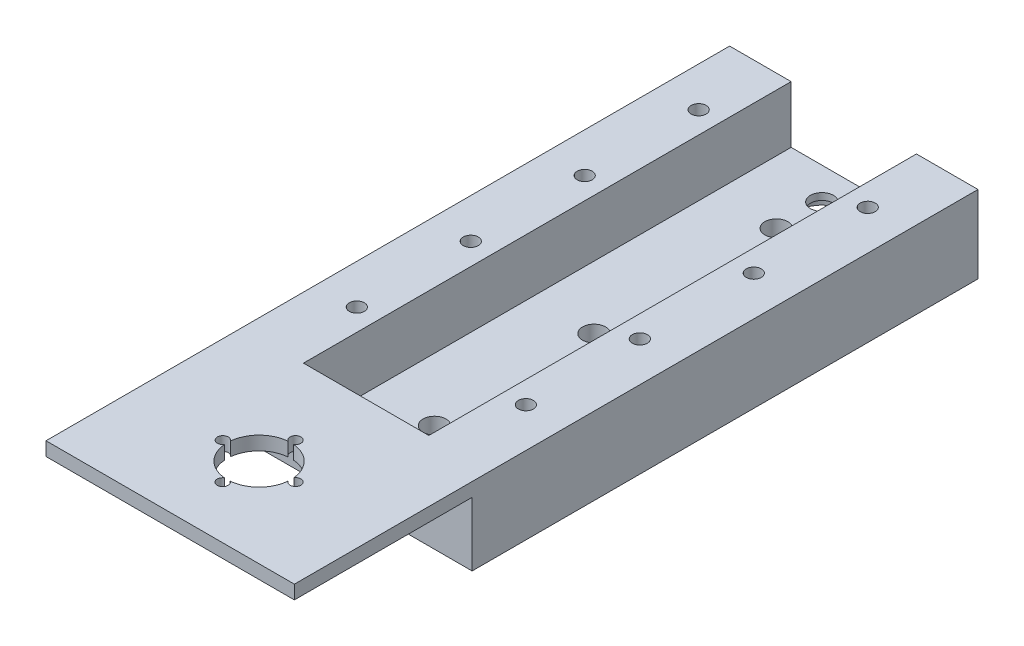
ISO-10303-21;
HEADER;
FILE_DESCRIPTION(('STEP AP214'),'2;1');
FILE_NAME('part.step','',(''),(''),'','','');
FILE_SCHEMA(('AUTOMOTIVE_DESIGN { 1 0 10303 214 1 1 1 1 }'));
ENDSEC;
DATA;
#1=APPLICATION_CONTEXT('core data for automotive mechanical design processes');
#2=APPLICATION_PROTOCOL_DEFINITION('international standard','automotive_design',2000,#1);
#3=PRODUCT_CONTEXT('',#1,'mechanical');
#4=PRODUCT('Part','Part','',(#3));
#5=PRODUCT_RELATED_PRODUCT_CATEGORY('part','',(#4));
#6=PRODUCT_DEFINITION_FORMATION('','',#4);
#7=PRODUCT_DEFINITION_CONTEXT('part definition',#1,'design');
#8=PRODUCT_DEFINITION('design','',#6,#7);
#9=PRODUCT_DEFINITION_SHAPE('','',#8);
#10=(LENGTH_UNIT() NAMED_UNIT(*) SI_UNIT(.MILLI.,.METRE.));
#11=(NAMED_UNIT(*) PLANE_ANGLE_UNIT() SI_UNIT($,.RADIAN.));
#12=(NAMED_UNIT(*) SI_UNIT($,.STERADIAN.) SOLID_ANGLE_UNIT());
#13=UNCERTAINTY_MEASURE_WITH_UNIT(LENGTH_MEASURE(1.E-05),#10,'distance_accuracy_value','');
#14=(GEOMETRIC_REPRESENTATION_CONTEXT(3) GLOBAL_UNCERTAINTY_ASSIGNED_CONTEXT((#13)) GLOBAL_UNIT_ASSIGNED_CONTEXT((#10,
#11,#12)) REPRESENTATION_CONTEXT('',''));
#15=CARTESIAN_POINT('',(0.,0.,0.));
#16=DIRECTION('',(0.,0.,1.));
#17=DIRECTION('',(1.,0.,0.));
#18=AXIS2_PLACEMENT_3D('',#15,#16,#17);
#19=CARTESIAN_POINT('',(-13.3995438408786,4.5,-92.6293125841432));
#20=DIRECTION('',(0.,1.,0.));
#21=DIRECTION('',(0.,0.,1.));
#22=AXIS2_PLACEMENT_3D('',#19,#20,#21);
#23=CYLINDRICAL_SURFACE('',#22,2.5273);
#24=CARTESIAN_POINT('',(-13.3995438408786,4.5,-92.6293125841432));
#25=DIRECTION('',(0.,1.,0.));
#26=DIRECTION('',(0.,0.,1.));
#27=AXIS2_PLACEMENT_3D('',#24,#25,#26);
#28=CIRCLE('',#27,2.5273);
#29=CARTESIAN_POINT('',(-13.3995438408786,4.5,-90.1020125841432));
#30=VERTEX_POINT('',#29);
#31=EDGE_CURVE('E168',#30,#30,#28,.T.);
#32=ORIENTED_EDGE('',*,*,#31,.T.);
#33=EDGE_LOOP('',(#32));
#34=FACE_BOUND('',#33,.T.);
#35=CARTESIAN_POINT('',(-13.3995438408786,3.,-92.6293125841432));
#36=DIRECTION('',(0.,-1.,0.));
#37=DIRECTION('',(0.,0.,-1.));
#38=AXIS2_PLACEMENT_3D('',#35,#36,#37);
#39=CIRCLE('',#38,2.5273);
#40=CARTESIAN_POINT('',(-13.3995438408786,3.,-95.1566125841432));
#41=VERTEX_POINT('',#40);
#42=EDGE_CURVE('E41',#41,#41,#39,.F.);
#43=ORIENTED_EDGE('',*,*,#42,.F.);
#44=EDGE_LOOP('',(#43));
#45=FACE_BOUND('',#44,.T.);
#46=ADVANCED_FACE('F37',(#34,#45),#23,.F.);
#47=CARTESIAN_POINT('',(-13.3995438408786,14.,30.8706874158568));
#48=DIRECTION('',(0.,1.,0.));
#49=DIRECTION('',(0.,0.,1.));
#50=AXIS2_PLACEMENT_3D('',#47,#48,#49);
#51=CYLINDRICAL_SURFACE('',#50,7.);
#52=CARTESIAN_POINT('',(-13.3995438408786,14.,30.8706874158568));
#53=DIRECTION('',(0.,1.,0.));
#54=DIRECTION('',(0.,0.,1.));
#55=AXIS2_PLACEMENT_3D('',#52,#53,#54);
#56=CIRCLE('',#55,7.);
#57=CARTESIAN_POINT('',(-20.3703289447228,14.,31.5095575403921));
#58=VERTEX_POINT('',#57);
#59=CARTESIAN_POINT('',(-14.0194178200066,14.,37.8431874158568));
#60=VERTEX_POINT('',#59);
#61=EDGE_CURVE('E176',#58,#60,#56,.T.);
#62=ORIENTED_EDGE('',*,*,#61,.F.);
#63=DIRECTION('',(0.,1.,0.));
#64=VECTOR('',#63,1.);
#65=CARTESIAN_POINT('',(-20.3703289447228,8.5,31.5095575403921));
#66=LINE('',#65,#64);
#67=CARTESIAN_POINT('',(-20.3703289447228,17.,31.5095575403921));
#68=VERTEX_POINT('',#67);
#69=EDGE_CURVE('E53',#58,#68,#66,.T.);
#70=ORIENTED_EDGE('',*,*,#69,.T.);
#71=CARTESIAN_POINT('',(-13.3995438408786,17.,30.8706874158568));
#72=DIRECTION('',(0.,1.,0.));
#73=DIRECTION('',(0.,0.,1.));
#74=AXIS2_PLACEMENT_3D('',#71,#72,#73);
#75=CIRCLE('',#74,7.);
#76=CARTESIAN_POINT('',(-14.0194178200066,17.,37.8431874158568));
#77=VERTEX_POINT('',#76);
#78=EDGE_CURVE('E174',#68,#77,#75,.T.);
#79=ORIENTED_EDGE('',*,*,#78,.T.);
#80=DIRECTION('',(0.,1.,0.));
#81=VECTOR('',#80,1.);
#82=CARTESIAN_POINT('',(-14.0194178200066,8.5,37.8431874158568));
#83=LINE('',#82,#81);
#84=EDGE_CURVE('E217',#77,#60,#83,.F.);
#85=ORIENTED_EDGE('',*,*,#84,.T.);
#86=EDGE_LOOP('',(#62,#70,#79,#85));
#87=FACE_BOUND('',#86,.T.);
#88=ADVANCED_FACE('F172',(#87),#51,.F.);
#89=CARTESIAN_POINT('',(0.,17.,0.));
#90=DIRECTION('',(0.,-1.,0.));
#91=DIRECTION('',(0.,0.,-1.));
#92=AXIS2_PLACEMENT_3D('',#89,#90,#91);
#93=PLANE('',#92);
#94=CARTESIAN_POINT('',(5.15045615912143,17.,-9.1293125841432));
#95=DIRECTION('',(0.,1.,0.));
#96=DIRECTION('',(0.,0.,1.));
#97=AXIS2_PLACEMENT_3D('',#94,#95,#96);
#98=CIRCLE('',#97,1.65);
#99=CARTESIAN_POINT('',(5.15045615912143,17.,-7.4793125841432));
#100=VERTEX_POINT('',#99);
#101=EDGE_CURVE('E311',#100,#100,#98,.T.);
#102=ORIENTED_EDGE('',*,*,#101,.F.);
#103=EDGE_LOOP('',(#102));
#104=FACE_BOUND('',#103,.T.);
#105=CARTESIAN_POINT('',(5.15045615912143,17.,-34.1293125841432));
#106=DIRECTION('',(0.,1.,0.));
#107=DIRECTION('',(0.,0.,1.));
#108=AXIS2_PLACEMENT_3D('',#105,#106,#107);
#109=CIRCLE('',#108,1.65);
#110=CARTESIAN_POINT('',(5.15045615912143,17.,-32.4793125841432));
#111=VERTEX_POINT('',#110);
#112=EDGE_CURVE('E305',#111,#111,#109,.T.);
#113=ORIENTED_EDGE('',*,*,#112,.F.);
#114=EDGE_LOOP('',(#113));
#115=FACE_BOUND('',#114,.T.);
#116=CARTESIAN_POINT('',(5.15045615912143,17.,-59.1293125841432));
#117=DIRECTION('',(0.,1.,0.));
#118=DIRECTION('',(0.,0.,1.));
#119=AXIS2_PLACEMENT_3D('',#116,#117,#118);
#120=CIRCLE('',#119,1.65);
#121=CARTESIAN_POINT('',(5.15045615912143,17.,-57.4793125841432));
#122=VERTEX_POINT('',#121);
#123=EDGE_CURVE('E299',#122,#122,#120,.T.);
#124=ORIENTED_EDGE('',*,*,#123,.F.);
#125=EDGE_LOOP('',(#124));
#126=FACE_BOUND('',#125,.T.);
#127=CARTESIAN_POINT('',(5.15045615912143,17.,-84.1293125841432));
#128=DIRECTION('',(0.,1.,0.));
#129=DIRECTION('',(0.,0.,1.));
#130=AXIS2_PLACEMENT_3D('',#127,#128,#129);
#131=CIRCLE('',#130,1.65);
#132=CARTESIAN_POINT('',(5.15045615912143,17.,-82.4793125841432));
#133=VERTEX_POINT('',#132);
#134=EDGE_CURVE('E293',#133,#133,#131,.T.);
#135=ORIENTED_EDGE('',*,*,#134,.F.);
#136=EDGE_LOOP('',(#135));
#137=FACE_BOUND('',#136,.T.);
#138=DIRECTION('',(0.,0.,1.));
#139=VECTOR('',#138,1.);
#140=CARTESIAN_POINT('',(-40.6495438408786,17.,-99.6293125841432));
#141=LINE('',#140,#139);
#142=CARTESIAN_POINT('',(-40.6495438408786,17.,-99.6293125841432));
#143=VERTEX_POINT('',#142);
#144=CARTESIAN_POINT('',(-40.6495438408786,17.,50.3706874158568));
#145=VERTEX_POINT('',#144);
#146=EDGE_CURVE('E265',#143,#145,#141,.T.);
#147=ORIENTED_EDGE('',*,*,#146,.T.);
#148=DIRECTION('',(-1.,0.,0.));
#149=VECTOR('',#148,1.);
#150=CARTESIAN_POINT('',(-40.6495438408786,17.,50.3706874158568));
#151=LINE('',#150,#149);
#152=CARTESIAN_POINT('',(13.8504561591214,17.,50.3706874158568));
#153=VERTEX_POINT('',#152);
#154=EDGE_CURVE('E353',#153,#145,#151,.T.);
#155=ORIENTED_EDGE('',*,*,#154,.F.);
#156=DIRECTION('',(0.,0.,1.));
#157=VECTOR('',#156,1.);
#158=CARTESIAN_POINT('',(13.8504561591214,17.,-99.6293125841432));
#159=LINE('',#158,#157);
#160=CARTESIAN_POINT('',(13.8504561591214,17.,-99.6293125841432));
#161=VERTEX_POINT('',#160);
#162=EDGE_CURVE('E277',#161,#153,#159,.T.);
#163=ORIENTED_EDGE('',*,*,#162,.F.);
#164=DIRECTION('',(1.,0.,0.));
#165=VECTOR('',#164,1.);
#166=CARTESIAN_POINT('',(0.350456159121413,17.,-99.6293125841432));
#167=LINE('',#166,#165);
#168=CARTESIAN_POINT('',(0.350456159121413,17.,-99.6293125841432));
#169=VERTEX_POINT('',#168);
#170=EDGE_CURVE('E279',#169,#161,#167,.T.);
#171=ORIENTED_EDGE('',*,*,#170,.F.);
#172=DIRECTION('',(0.,0.,1.));
#173=VECTOR('',#172,1.);
#174=CARTESIAN_POINT('',(0.350456159121413,17.,-99.6293125841432));
#175=LINE('',#174,#173);
#176=CARTESIAN_POINT('',(0.350456159121413,17.,7.37068741585679));
#177=VERTEX_POINT('',#176);
#178=EDGE_CURVE('E282',#169,#177,#175,.T.);
#179=ORIENTED_EDGE('',*,*,#178,.T.);
#180=DIRECTION('',(-1.,0.,0.));
#181=VECTOR('',#180,1.);
#182=CARTESIAN_POINT('',(9.85045615912145,17.,7.37068741585679));
#183=LINE('',#182,#181);
#184=CARTESIAN_POINT('',(-27.1495438408786,17.,7.3706874158568));
#185=VERTEX_POINT('',#184);
#186=EDGE_CURVE('E342',#177,#185,#183,.T.);
#187=ORIENTED_EDGE('',*,*,#186,.T.);
#188=DIRECTION('',(0.,0.,1.));
#189=VECTOR('',#188,1.);
#190=CARTESIAN_POINT('',(-27.1495438408786,17.,-99.6293125841432));
#191=LINE('',#190,#189);
#192=CARTESIAN_POINT('',(-27.1495438408786,17.,-99.6293125841432));
#193=VERTEX_POINT('',#192);
#194=EDGE_CURVE('E269',#193,#185,#191,.T.);
#195=ORIENTED_EDGE('',*,*,#194,.F.);
#196=DIRECTION('',(1.,0.,0.));
#197=VECTOR('',#196,1.);
#198=CARTESIAN_POINT('',(-40.6495438408786,17.,-99.6293125841432));
#199=LINE('',#198,#197);
#200=EDGE_CURVE('E272',#143,#193,#199,.T.);
#201=ORIENTED_EDGE('',*,*,#200,.F.);
#202=EDGE_LOOP('',(#147,#155,#163,#171,#179,#187,#195,#201));
#203=FACE_BOUND('',#202,.T.);
#204=CARTESIAN_POINT('',(-31.9495438408786,17.,-84.1293125841432));
#205=DIRECTION('',(0.,1.,0.));
#206=DIRECTION('',(0.,0.,1.));
#207=AXIS2_PLACEMENT_3D('',#204,#205,#206);
#208=CIRCLE('',#207,1.65);
#209=CARTESIAN_POINT('',(-31.9495438408786,17.,-82.4793125841432));
#210=VERTEX_POINT('',#209);
#211=EDGE_CURVE('E317',#210,#210,#208,.T.);
#212=ORIENTED_EDGE('',*,*,#211,.F.);
#213=EDGE_LOOP('',(#212));
#214=FACE_BOUND('',#213,.T.);
#215=CARTESIAN_POINT('',(-31.9495438408786,17.,-59.1293125841432));
#216=DIRECTION('',(0.,1.,0.));
#217=DIRECTION('',(0.,0.,1.));
#218=AXIS2_PLACEMENT_3D('',#215,#216,#217);
#219=CIRCLE('',#218,1.65);
#220=CARTESIAN_POINT('',(-31.9495438408786,17.,-57.4793125841432));
#221=VERTEX_POINT('',#220);
#222=EDGE_CURVE('E323',#221,#221,#219,.T.);
#223=ORIENTED_EDGE('',*,*,#222,.F.);
#224=EDGE_LOOP('',(#223));
#225=FACE_BOUND('',#224,.T.);
#226=CARTESIAN_POINT('',(-31.9495438408786,17.,-34.1293125841432));
#227=DIRECTION('',(0.,1.,0.));
#228=DIRECTION('',(0.,0.,1.));
#229=AXIS2_PLACEMENT_3D('',#226,#227,#228);
#230=CIRCLE('',#229,1.65);
#231=CARTESIAN_POINT('',(-31.9495438408786,17.,-32.4793125841432));
#232=VERTEX_POINT('',#231);
#233=EDGE_CURVE('E329',#232,#232,#230,.T.);
#234=ORIENTED_EDGE('',*,*,#233,.F.);
#235=EDGE_LOOP('',(#234));
#236=FACE_BOUND('',#235,.T.);
#237=CARTESIAN_POINT('',(-31.9495438408786,17.,-9.1293125841432));
#238=DIRECTION('',(0.,1.,0.));
#239=DIRECTION('',(0.,0.,1.));
#240=AXIS2_PLACEMENT_3D('',#237,#238,#239);
#241=CIRCLE('',#240,1.65);
#242=CARTESIAN_POINT('',(-31.9495438408786,17.,-7.4793125841432));
#243=VERTEX_POINT('',#242);
#244=EDGE_CURVE('E335',#243,#243,#241,.T.);
#245=ORIENTED_EDGE('',*,*,#244,.F.);
#246=EDGE_LOOP('',(#245));
#247=FACE_BOUND('',#246,.T.);
#248=CARTESIAN_POINT('',(-21.3714371180351,17.,30.8479062535898));
#249=DIRECTION('',(0.,1.,0.));
#250=DIRECTION('',(0.,0.,1.));
#251=AXIS2_PLACEMENT_3D('',#248,#249,#250);
#252=CIRCLE('',#251,1.2);
#253=CARTESIAN_POINT('',(-20.3665637439829,17.,30.1919874307764));
#254=VERTEX_POINT('',#253);
#255=EDGE_CURVE('E160',#254,#68,#252,.T.);
#256=ORIENTED_EDGE('',*,*,#255,.F.);
#257=CARTESIAN_POINT('',(-14.0194178200066,17.,23.8981874158568));
#258=VERTEX_POINT('',#257);
#259=EDGE_CURVE('E183',#258,#254,#75,.T.);
#260=ORIENTED_EDGE('',*,*,#259,.F.);
#261=CARTESIAN_POINT('',(-13.3995438408786,17.,22.8706874158568));
#262=DIRECTION('',(0.,1.,0.));
#263=DIRECTION('',(0.,0.,1.));
#264=AXIS2_PLACEMENT_3D('',#261,#262,#263);
#265=CIRCLE('',#264,1.2);
#266=CARTESIAN_POINT('',(-12.7796698617505,17.,23.8981874158568));
#267=VERTEX_POINT('',#266);
#268=EDGE_CURVE('E177',#267,#258,#265,.T.);
#269=ORIENTED_EDGE('',*,*,#268,.F.);
#270=CARTESIAN_POINT('',(-6.43313001042027,17.,30.1857944732743));
#271=VERTEX_POINT('',#270);
#272=EDGE_CURVE('E186',#271,#267,#75,.T.);
#273=ORIENTED_EDGE('',*,*,#272,.F.);
#274=CARTESIAN_POINT('',(-5.43047554219228,17.,30.8451001818363));
#275=DIRECTION('',(0.,1.,0.));
#276=DIRECTION('',(0.,0.,1.));
#277=AXIS2_PLACEMENT_3D('',#274,#275,#276);
#278=CIRCLE('',#277,1.2);
#279=CARTESIAN_POINT('',(-6.42887555855517,17.,31.5108309136841));
#280=VERTEX_POINT('',#279);
#281=EDGE_CURVE('E224',#280,#271,#278,.T.);
#282=ORIENTED_EDGE('',*,*,#281,.F.);
#283=CARTESIAN_POINT('',(-12.7796698617506,17.,37.8431874158568));
#284=VERTEX_POINT('',#283);
#285=EDGE_CURVE('E184',#284,#280,#75,.T.);
#286=ORIENTED_EDGE('',*,*,#285,.F.);
#287=CARTESIAN_POINT('',(-13.3995438408786,17.,38.8706874158568));
#288=DIRECTION('',(0.,-1.,0.));
#289=DIRECTION('',(0.,0.,-1.));
#290=AXIS2_PLACEMENT_3D('',#287,#288,#289);
#291=CIRCLE('',#290,1.2);
#292=EDGE_CURVE('E182',#284,#77,#291,.T.);
#293=ORIENTED_EDGE('',*,*,#292,.T.);
#294=ORIENTED_EDGE('',*,*,#78,.F.);
#295=EDGE_LOOP('',(#256,#260,#269,#273,#282,#286,#293,#294));
#296=FACE_BOUND('',#295,.T.);
#297=ADVANCED_FACE('F180',(#104,#115,#126,#137,#203,#214,#225,#236,#247,#296),#93,.F.);
#298=ORIENTED_EDGE('',*,*,#259,.T.);
#299=DIRECTION('',(0.,1.,0.));
#300=VECTOR('',#299,1.);
#301=CARTESIAN_POINT('',(-20.3665637439829,8.5,30.1919874307764));
#302=LINE('',#301,#300);
#303=CARTESIAN_POINT('',(-20.3665637439829,14.,30.1919874307764));
#304=VERTEX_POINT('',#303);
#305=EDGE_CURVE('E163',#254,#304,#302,.F.);
#306=ORIENTED_EDGE('',*,*,#305,.T.);
#307=CARTESIAN_POINT('',(-14.0194178200066,14.,23.8981874158568));
#308=VERTEX_POINT('',#307);
#309=EDGE_CURVE('E196',#308,#304,#56,.T.);
#310=ORIENTED_EDGE('',*,*,#309,.F.);
#311=DIRECTION('',(0.,1.,0.));
#312=VECTOR('',#311,1.);
#313=CARTESIAN_POINT('',(-14.0194178200066,8.5,23.8981874158568));
#314=LINE('',#313,#312);
#315=EDGE_CURVE('E46',#308,#258,#314,.T.);
#316=ORIENTED_EDGE('',*,*,#315,.T.);
#317=EDGE_LOOP('',(#298,#306,#310,#316));
#318=FACE_BOUND('',#317,.T.);
#319=ADVANCED_FACE('F211',(#318),#51,.F.);
#320=CARTESIAN_POINT('',(-12.7796698617506,14.,37.8431874158568));
#321=VERTEX_POINT('',#320);
#322=CARTESIAN_POINT('',(-6.42887555855517,14.,31.5108309136841));
#323=VERTEX_POINT('',#322);
#324=EDGE_CURVE('E191',#321,#323,#56,.T.);
#325=ORIENTED_EDGE('',*,*,#324,.F.);
#326=DIRECTION('',(0.,1.,0.));
#327=VECTOR('',#326,1.);
#328=CARTESIAN_POINT('',(-12.7796698617506,8.5,37.8431874158568));
#329=LINE('',#328,#327);
#330=EDGE_CURVE('E221',#321,#284,#329,.T.);
#331=ORIENTED_EDGE('',*,*,#330,.T.);
#332=ORIENTED_EDGE('',*,*,#285,.T.);
#333=DIRECTION('',(0.,1.,0.));
#334=VECTOR('',#333,1.);
#335=CARTESIAN_POINT('',(-6.42887555855517,8.5,31.5108309136841));
#336=LINE('',#335,#334);
#337=EDGE_CURVE('E238',#280,#323,#336,.F.);
#338=ORIENTED_EDGE('',*,*,#337,.T.);
#339=EDGE_LOOP('',(#325,#331,#332,#338));
#340=FACE_BOUND('',#339,.T.);
#341=ADVANCED_FACE('F444',(#340),#51,.F.);
#342=CARTESIAN_POINT('',(-40.6495438408786,4.5,11.3706874158568));
#343=DIRECTION('',(0.,0.,-1.));
#344=DIRECTION('',(-1.,0.,0.));
#345=AXIS2_PLACEMENT_3D('',#342,#343,#344);
#346=PLANE('',#345);
#347=DIRECTION('',(1.,0.,0.));
#348=VECTOR('',#347,1.);
#349=CARTESIAN_POINT('',(-40.6495438408786,14.,11.3706874158568));
#350=LINE('',#349,#348);
#351=CARTESIAN_POINT('',(-40.6495438408786,14.,11.3706874158568));
#352=VERTEX_POINT('',#351);
#353=CARTESIAN_POINT('',(13.8504561591214,14.,11.3706874158568));
#354=VERTEX_POINT('',#353);
#355=EDGE_CURVE('E204',#352,#354,#350,.T.);
#356=ORIENTED_EDGE('',*,*,#355,.F.);
#357=DIRECTION('',(0.,-1.,0.));
#358=VECTOR('',#357,1.);
#359=CARTESIAN_POINT('',(-40.6495438408786,4.5,11.3706874158568));
#360=LINE('',#359,#358);
#361=CARTESIAN_POINT('',(-40.6495438408786,0.,11.3706874158568));
#362=VERTEX_POINT('',#361);
#363=EDGE_CURVE('E240',#352,#362,#360,.T.);
#364=ORIENTED_EDGE('',*,*,#363,.T.);
#365=DIRECTION('',(1.,0.,0.));
#366=VECTOR('',#365,1.);
#367=CARTESIAN_POINT('',(-40.6495438408786,0.,11.3706874158568));
#368=LINE('',#367,#366);
#369=CARTESIAN_POINT('',(13.8504561591214,0.,11.3706874158568));
#370=VERTEX_POINT('',#369);
#371=EDGE_CURVE('E255',#362,#370,#368,.T.);
#372=ORIENTED_EDGE('',*,*,#371,.T.);
#373=DIRECTION('',(0.,-1.,0.));
#374=VECTOR('',#373,1.);
#375=CARTESIAN_POINT('',(13.8504561591214,4.5,11.3706874158568));
#376=LINE('',#375,#374);
#377=EDGE_CURVE('E242',#354,#370,#376,.T.);
#378=ORIENTED_EDGE('',*,*,#377,.F.);
#379=EDGE_LOOP('',(#356,#364,#372,#378));
#380=FACE_BOUND('',#379,.T.);
#381=ADVANCED_FACE('F390',(#380),#346,.F.);
#382=CARTESIAN_POINT('',(0.,4.5,0.));
#383=DIRECTION('',(0.,-1.,0.));
#384=DIRECTION('',(0.,0.,-1.));
#385=AXIS2_PLACEMENT_3D('',#382,#383,#384);
#386=PLANE('',#385);
#387=CARTESIAN_POINT('',(-13.3995438408786,4.5,2.37068741585679));
#388=DIRECTION('',(0.,1.,0.));
#389=DIRECTION('',(0.,0.,1.));
#390=AXIS2_PLACEMENT_3D('',#387,#388,#389);
#391=CIRCLE('',#390,2.5273);
#392=CARTESIAN_POINT('',(-13.3995438408786,4.5,4.89798741585679));
#393=VERTEX_POINT('',#392);
#394=EDGE_CURVE('E583',#393,#393,#391,.T.);
#395=ORIENTED_EDGE('',*,*,#394,.F.);
#396=EDGE_LOOP('',(#395));
#397=FACE_BOUND('',#396,.T.);
#398=CARTESIAN_POINT('',(-13.3995438408786,4.5,-7.62931258414321));
#399=DIRECTION('',(0.,1.,0.));
#400=DIRECTION('',(0.,0.,1.));
#401=AXIS2_PLACEMENT_3D('',#398,#399,#400);
#402=CIRCLE('',#401,2.5273);
#403=CARTESIAN_POINT('',(-13.3995438408786,4.5,-5.10201258414321));
#404=VERTEX_POINT('',#403);
#405=EDGE_CURVE('E579',#404,#404,#402,.T.);
#406=ORIENTED_EDGE('',*,*,#405,.F.);
#407=EDGE_LOOP('',(#406));
#408=FACE_BOUND('',#407,.T.);
#409=CARTESIAN_POINT('',(-13.3995438408786,4.5,-42.6293125841432));
#410=DIRECTION('',(0.,1.,0.));
#411=DIRECTION('',(0.,0.,1.));
#412=AXIS2_PLACEMENT_3D('',#409,#410,#411);
#413=CIRCLE('',#412,2.5273);
#414=CARTESIAN_POINT('',(-13.3995438408786,4.5,-40.1020125841432));
#415=VERTEX_POINT('',#414);
#416=EDGE_CURVE('E575',#415,#415,#413,.T.);
#417=ORIENTED_EDGE('',*,*,#416,.F.);
#418=EDGE_LOOP('',(#417));
#419=FACE_BOUND('',#418,.T.);
#420=CARTESIAN_POINT('',(-13.3995438408786,4.5,-82.6293125841432));
#421=DIRECTION('',(0.,1.,0.));
#422=DIRECTION('',(0.,0.,1.));
#423=AXIS2_PLACEMENT_3D('',#420,#421,#422);
#424=CIRCLE('',#423,2.5273);
#425=CARTESIAN_POINT('',(-13.3995438408786,4.5,-80.1020125841432));
#426=VERTEX_POINT('',#425);
#427=EDGE_CURVE('E569',#426,#426,#424,.T.);
#428=ORIENTED_EDGE('',*,*,#427,.F.);
#429=EDGE_LOOP('',(#428));
#430=FACE_BOUND('',#429,.T.);
#431=ORIENTED_EDGE('',*,*,#31,.F.);
#432=EDGE_LOOP('',(#431));
#433=FACE_BOUND('',#432,.T.);
#434=DIRECTION('',(-1.,0.,0.));
#435=VECTOR('',#434,1.);
#436=CARTESIAN_POINT('',(9.85045615912145,4.5,7.37068741585679));
#437=LINE('',#436,#435);
#438=CARTESIAN_POINT('',(0.350456159121427,4.5,7.37068741585679));
#439=VERTEX_POINT('',#438);
#440=CARTESIAN_POINT('',(-27.1495438408786,4.5,7.3706874158568));
#441=VERTEX_POINT('',#440);
#442=EDGE_CURVE('E340',#439,#441,#437,.T.);
#443=ORIENTED_EDGE('',*,*,#442,.F.);
#444=DIRECTION('',(0.,0.,1.));
#445=VECTOR('',#444,1.);
#446=CARTESIAN_POINT('',(0.350456159121413,4.5,-99.6293125841432));
#447=LINE('',#446,#445);
#448=CARTESIAN_POINT('',(0.350456159121423,4.5,-99.6293125841432));
#449=VERTEX_POINT('',#448);
#450=EDGE_CURVE('E270',#449,#439,#447,.T.);
#451=ORIENTED_EDGE('',*,*,#450,.F.);
#452=DIRECTION('',(-1.,0.,0.));
#453=VECTOR('',#452,1.);
#454=CARTESIAN_POINT('',(-40.6495438408786,4.5,-99.6293125841432));
#455=LINE('',#454,#453);
#456=CARTESIAN_POINT('',(-27.1495438408786,4.5,-99.6293125841432));
#457=VERTEX_POINT('',#456);
#458=EDGE_CURVE('E250',#449,#457,#455,.T.);
#459=ORIENTED_EDGE('',*,*,#458,.T.);
#460=DIRECTION('',(0.,0.,1.));
#461=VECTOR('',#460,1.);
#462=CARTESIAN_POINT('',(-27.1495438408786,4.5,-99.6293125841432));
#463=LINE('',#462,#461);
#464=EDGE_CURVE('E266',#457,#441,#463,.T.);
#465=ORIENTED_EDGE('',*,*,#464,.T.);
#466=EDGE_LOOP('',(#443,#451,#459,#465));
#467=FACE_BOUND('',#466,.T.);
#468=ADVANCED_FACE('F402',(#397,#408,#419,#430,#433,#467),#386,.F.);
#469=CARTESIAN_POINT('',(-27.1495438408786,17.,-99.6293125841432));
#470=DIRECTION('',(1.,0.,0.));
#471=DIRECTION('',(0.,0.,-1.));
#472=AXIS2_PLACEMENT_3D('',#469,#470,#471);
#473=PLANE('',#472);
#474=ORIENTED_EDGE('',*,*,#194,.T.);
#475=DIRECTION('',(0.,1.,0.));
#476=VECTOR('',#475,1.);
#477=CARTESIAN_POINT('',(-27.1495438408786,17.,7.3706874158568));
#478=LINE('',#477,#476);
#479=EDGE_CURVE('E344',#441,#185,#478,.T.);
#480=ORIENTED_EDGE('',*,*,#479,.F.);
#481=ORIENTED_EDGE('',*,*,#464,.F.);
#482=DIRECTION('',(0.,-1.,0.));
#483=VECTOR('',#482,1.);
#484=CARTESIAN_POINT('',(-27.1495438408786,17.,-99.6293125841432));
#485=LINE('',#484,#483);
#486=EDGE_CURVE('E261',#193,#457,#485,.T.);
#487=ORIENTED_EDGE('',*,*,#486,.F.);
#488=EDGE_LOOP('',(#474,#480,#481,#487));
#489=FACE_BOUND('',#488,.T.);
#490=ADVANCED_FACE('F405',(#489),#473,.T.);
#491=CARTESIAN_POINT('',(0.350456159121413,17.,-99.6293125841432));
#492=DIRECTION('',(1.,0.,0.));
#493=DIRECTION('',(0.,0.,-1.));
#494=AXIS2_PLACEMENT_3D('',#491,#492,#493);
#495=PLANE('',#494);
#496=DIRECTION('',(0.,-1.,0.));
#497=VECTOR('',#496,1.);
#498=CARTESIAN_POINT('',(0.350456159121426,17.,7.37068741585679));
#499=LINE('',#498,#497);
#500=EDGE_CURVE('E338',#177,#439,#499,.T.);
#501=ORIENTED_EDGE('',*,*,#500,.F.);
#502=ORIENTED_EDGE('',*,*,#178,.F.);
#503=DIRECTION('',(0.,-1.,0.));
#504=VECTOR('',#503,1.);
#505=CARTESIAN_POINT('',(0.350456159121413,17.,-99.6293125841432));
#506=LINE('',#505,#504);
#507=EDGE_CURVE('E285',#169,#449,#506,.T.);
#508=ORIENTED_EDGE('',*,*,#507,.T.);
#509=ORIENTED_EDGE('',*,*,#450,.T.);
#510=EDGE_LOOP('',(#501,#502,#508,#509));
#511=FACE_BOUND('',#510,.T.);
#512=ADVANCED_FACE('F396',(#511),#495,.F.);
#513=CARTESIAN_POINT('',(-40.6495438408786,4.5,11.3706874158568));
#514=DIRECTION('',(1.,0.,0.));
#515=DIRECTION('',(0.,0.,-1.));
#516=AXIS2_PLACEMENT_3D('',#513,#514,#515);
#517=PLANE('',#516);
#518=DIRECTION('',(0.,0.,1.));
#519=VECTOR('',#518,1.);
#520=CARTESIAN_POINT('',(-40.6495438408786,0.,11.3706874158568));
#521=LINE('',#520,#519);
#522=CARTESIAN_POINT('',(-40.6495438408786,0.,-99.6293125841432));
#523=VERTEX_POINT('',#522);
#524=EDGE_CURVE('E258',#523,#362,#521,.T.);
#525=ORIENTED_EDGE('',*,*,#524,.T.);
#526=ORIENTED_EDGE('',*,*,#363,.F.);
#527=DIRECTION('',(0.,0.,-1.));
#528=VECTOR('',#527,1.);
#529=CARTESIAN_POINT('',(-40.6495438408786,14.,50.3706874158568));
#530=LINE('',#529,#528);
#531=CARTESIAN_POINT('',(-40.6495438408786,14.,50.3706874158568));
#532=VERTEX_POINT('',#531);
#533=EDGE_CURVE('E347',#532,#352,#530,.T.);
#534=ORIENTED_EDGE('',*,*,#533,.F.);
#535=DIRECTION('',(0.,-1.,0.));
#536=VECTOR('',#535,1.);
#537=CARTESIAN_POINT('',(-40.6495438408786,17.,50.3706874158568));
#538=LINE('',#537,#536);
#539=EDGE_CURVE('E356',#145,#532,#538,.T.);
#540=ORIENTED_EDGE('',*,*,#539,.F.);
#541=ORIENTED_EDGE('',*,*,#146,.F.);
#542=DIRECTION('',(0.,-1.,0.));
#543=VECTOR('',#542,1.);
#544=CARTESIAN_POINT('',(-40.6495438408786,4.5,-99.6293125841432));
#545=LINE('',#544,#543);
#546=EDGE_CURVE('E247',#143,#523,#545,.T.);
#547=ORIENTED_EDGE('',*,*,#546,.T.);
#548=EDGE_LOOP('',(#525,#526,#534,#540,#541,#547));
#549=FACE_BOUND('',#548,.T.);
#550=ADVANCED_FACE('F39',(#549),#517,.F.);
#551=CARTESIAN_POINT('',(13.8504561591214,4.5,11.3706874158568));
#552=DIRECTION('',(-1.,0.,0.));
#553=DIRECTION('',(0.,0.,1.));
#554=AXIS2_PLACEMENT_3D('',#551,#552,#553);
#555=PLANE('',#554);
#556=DIRECTION('',(0.,0.,-1.));
#557=VECTOR('',#556,1.);
#558=CARTESIAN_POINT('',(13.8504561591214,0.,11.3706874158568));
#559=LINE('',#558,#557);
#560=CARTESIAN_POINT('',(13.8504561591214,0.,-99.6293125841432));
#561=VERTEX_POINT('',#560);
#562=EDGE_CURVE('E253',#370,#561,#559,.T.);
#563=ORIENTED_EDGE('',*,*,#562,.T.);
#564=DIRECTION('',(0.,-1.,0.));
#565=VECTOR('',#564,1.);
#566=CARTESIAN_POINT('',(13.8504561591214,4.5,-99.6293125841432));
#567=LINE('',#566,#565);
#568=EDGE_CURVE('E244',#161,#561,#567,.T.);
#569=ORIENTED_EDGE('',*,*,#568,.F.);
#570=ORIENTED_EDGE('',*,*,#162,.T.);
#571=DIRECTION('',(0.,1.,0.));
#572=VECTOR('',#571,1.);
#573=CARTESIAN_POINT('',(13.8504561591214,17.,50.3706874158568));
#574=LINE('',#573,#572);
#575=CARTESIAN_POINT('',(13.8504561591214,14.,50.3706874158568));
#576=VERTEX_POINT('',#575);
#577=EDGE_CURVE('E359',#576,#153,#574,.T.);
#578=ORIENTED_EDGE('',*,*,#577,.F.);
#579=DIRECTION('',(0.,0.,-1.));
#580=VECTOR('',#579,1.);
#581=CARTESIAN_POINT('',(13.8504561591214,14.,50.3706874158568));
#582=LINE('',#581,#580);
#583=EDGE_CURVE('E350',#576,#354,#582,.T.);
#584=ORIENTED_EDGE('',*,*,#583,.T.);
#585=ORIENTED_EDGE('',*,*,#377,.T.);
#586=EDGE_LOOP('',(#563,#569,#570,#578,#584,#585));
#587=FACE_BOUND('',#586,.T.);
#588=ADVANCED_FACE('F375',(#587),#555,.F.);
#589=CARTESIAN_POINT('',(-40.6495438408786,4.5,-99.6293125841432));
#590=DIRECTION('',(0.,0.,1.));
#591=DIRECTION('',(1.,0.,0.));
#592=AXIS2_PLACEMENT_3D('',#589,#590,#591);
#593=PLANE('',#592);
#594=DIRECTION('',(-1.,0.,0.));
#595=VECTOR('',#594,1.);
#596=CARTESIAN_POINT('',(-40.6495438408786,0.,-99.6293125841432));
#597=LINE('',#596,#595);
#598=EDGE_CURVE('E251',#561,#523,#597,.T.);
#599=ORIENTED_EDGE('',*,*,#598,.T.);
#600=ORIENTED_EDGE('',*,*,#546,.F.);
#601=ORIENTED_EDGE('',*,*,#200,.T.);
#602=ORIENTED_EDGE('',*,*,#486,.T.);
#603=ORIENTED_EDGE('',*,*,#458,.F.);
#604=ORIENTED_EDGE('',*,*,#507,.F.);
#605=ORIENTED_EDGE('',*,*,#170,.T.);
#606=ORIENTED_EDGE('',*,*,#568,.T.);
#607=EDGE_LOOP('',(#599,#600,#601,#602,#603,#604,#605,#606));
#608=FACE_BOUND('',#607,.T.);
#609=ADVANCED_FACE('F391',(#608),#593,.F.);
#610=CARTESIAN_POINT('',(0.,0.,0.));
#611=DIRECTION('',(0.,-1.,0.));
#612=DIRECTION('',(0.,0.,-1.));
#613=AXIS2_PLACEMENT_3D('',#610,#611,#612);
#614=PLANE('',#613);
#615=CARTESIAN_POINT('',(-13.3995438408786,0.,-92.6293125841432));
#616=DIRECTION('',(0.,-1.,0.));
#617=DIRECTION('',(0.,0.,-1.));
#618=AXIS2_PLACEMENT_3D('',#615,#616,#617);
#619=CIRCLE('',#618,5.5);
#620=CARTESIAN_POINT('',(-13.3995438408786,0.,-98.1293125841432));
#621=VERTEX_POINT('',#620);
#622=EDGE_CURVE('E525',#621,#621,#619,.T.);
#623=ORIENTED_EDGE('',*,*,#622,.F.);
#624=EDGE_LOOP('',(#623));
#625=FACE_BOUND('',#624,.T.);
#626=CARTESIAN_POINT('',(-13.3995438408786,0.,2.37068741585679));
#627=DIRECTION('',(0.,1.,0.));
#628=DIRECTION('',(0.,0.,1.));
#629=AXIS2_PLACEMENT_3D('',#626,#627,#628);
#630=CIRCLE('',#629,2.5273);
#631=CARTESIAN_POINT('',(-13.3995438408786,0.,4.89798741585679));
#632=VERTEX_POINT('',#631);
#633=EDGE_CURVE('E529',#632,#632,#630,.T.);
#634=ORIENTED_EDGE('',*,*,#633,.T.);
#635=EDGE_LOOP('',(#634));
#636=FACE_BOUND('',#635,.T.);
#637=CARTESIAN_POINT('',(-13.3995438408786,0.,-7.62931258414321));
#638=DIRECTION('',(0.,1.,0.));
#639=DIRECTION('',(0.,0.,1.));
#640=AXIS2_PLACEMENT_3D('',#637,#638,#639);
#641=CIRCLE('',#640,2.5273);
#642=CARTESIAN_POINT('',(-13.3995438408786,0.,-5.10201258414321));
#643=VERTEX_POINT('',#642);
#644=EDGE_CURVE('E533',#643,#643,#641,.T.);
#645=ORIENTED_EDGE('',*,*,#644,.T.);
#646=EDGE_LOOP('',(#645));
#647=FACE_BOUND('',#646,.T.);
#648=CARTESIAN_POINT('',(-13.3995438408786,0.,-42.6293125841432));
#649=DIRECTION('',(0.,1.,0.));
#650=DIRECTION('',(0.,0.,1.));
#651=AXIS2_PLACEMENT_3D('',#648,#649,#650);
#652=CIRCLE('',#651,2.5273);
#653=CARTESIAN_POINT('',(-13.3995438408786,0.,-40.1020125841432));
#654=VERTEX_POINT('',#653);
#655=EDGE_CURVE('E537',#654,#654,#652,.T.);
#656=ORIENTED_EDGE('',*,*,#655,.T.);
#657=EDGE_LOOP('',(#656));
#658=FACE_BOUND('',#657,.T.);
#659=CARTESIAN_POINT('',(-13.3995438408786,0.,-82.6293125841432));
#660=DIRECTION('',(0.,1.,0.));
#661=DIRECTION('',(0.,0.,1.));
#662=AXIS2_PLACEMENT_3D('',#659,#660,#661);
#663=CIRCLE('',#662,2.5273);
#664=CARTESIAN_POINT('',(-13.3995438408786,0.,-80.1020125841432));
#665=VERTEX_POINT('',#664);
#666=EDGE_CURVE('E541',#665,#665,#663,.T.);
#667=ORIENTED_EDGE('',*,*,#666,.T.);
#668=EDGE_LOOP('',(#667));
#669=FACE_BOUND('',#668,.T.);
#670=CARTESIAN_POINT('',(-31.9495438408786,0.,-9.1293125841432));
#671=DIRECTION('',(0.,1.,0.));
#672=DIRECTION('',(0.,0.,1.));
#673=AXIS2_PLACEMENT_3D('',#670,#671,#672);
#674=CIRCLE('',#673,1.65);
#675=CARTESIAN_POINT('',(-31.9495438408786,0.,-7.4793125841432));
#676=VERTEX_POINT('',#675);
#677=EDGE_CURVE('E332',#676,#676,#674,.T.);
#678=ORIENTED_EDGE('',*,*,#677,.T.);
#679=EDGE_LOOP('',(#678));
#680=FACE_BOUND('',#679,.T.);
#681=CARTESIAN_POINT('',(-31.9495438408786,0.,-34.1293125841432));
#682=DIRECTION('',(0.,1.,0.));
#683=DIRECTION('',(0.,0.,1.));
#684=AXIS2_PLACEMENT_3D('',#681,#682,#683);
#685=CIRCLE('',#684,1.65);
#686=CARTESIAN_POINT('',(-31.9495438408786,0.,-32.4793125841432));
#687=VERTEX_POINT('',#686);
#688=EDGE_CURVE('E326',#687,#687,#685,.T.);
#689=ORIENTED_EDGE('',*,*,#688,.T.);
#690=EDGE_LOOP('',(#689));
#691=FACE_BOUND('',#690,.T.);
#692=CARTESIAN_POINT('',(-31.9495438408786,0.,-59.1293125841432));
#693=DIRECTION('',(0.,1.,0.));
#694=DIRECTION('',(0.,0.,1.));
#695=AXIS2_PLACEMENT_3D('',#692,#693,#694);
#696=CIRCLE('',#695,1.65);
#697=CARTESIAN_POINT('',(-31.9495438408786,0.,-57.4793125841432));
#698=VERTEX_POINT('',#697);
#699=EDGE_CURVE('E320',#698,#698,#696,.T.);
#700=ORIENTED_EDGE('',*,*,#699,.T.);
#701=EDGE_LOOP('',(#700));
#702=FACE_BOUND('',#701,.T.);
#703=CARTESIAN_POINT('',(-31.9495438408786,0.,-84.1293125841432));
#704=DIRECTION('',(0.,1.,0.));
#705=DIRECTION('',(0.,0.,1.));
#706=AXIS2_PLACEMENT_3D('',#703,#704,#705);
#707=CIRCLE('',#706,1.65);
#708=CARTESIAN_POINT('',(-31.9495438408786,0.,-82.4793125841432));
#709=VERTEX_POINT('',#708);
#710=EDGE_CURVE('E314',#709,#709,#707,.T.);
#711=ORIENTED_EDGE('',*,*,#710,.T.);
#712=EDGE_LOOP('',(#711));
#713=FACE_BOUND('',#712,.T.);
#714=CARTESIAN_POINT('',(5.15045615912143,0.,-9.1293125841432));
#715=DIRECTION('',(0.,1.,0.));
#716=DIRECTION('',(0.,0.,1.));
#717=AXIS2_PLACEMENT_3D('',#714,#715,#716);
#718=CIRCLE('',#717,1.65);
#719=CARTESIAN_POINT('',(5.15045615912143,0.,-7.4793125841432));
#720=VERTEX_POINT('',#719);
#721=EDGE_CURVE('E308',#720,#720,#718,.T.);
#722=ORIENTED_EDGE('',*,*,#721,.T.);
#723=EDGE_LOOP('',(#722));
#724=FACE_BOUND('',#723,.T.);
#725=CARTESIAN_POINT('',(5.15045615912143,0.,-34.1293125841432));
#726=DIRECTION('',(0.,1.,0.));
#727=DIRECTION('',(0.,0.,1.));
#728=AXIS2_PLACEMENT_3D('',#725,#726,#727);
#729=CIRCLE('',#728,1.65);
#730=CARTESIAN_POINT('',(5.15045615912143,0.,-32.4793125841432));
#731=VERTEX_POINT('',#730);
#732=EDGE_CURVE('E302',#731,#731,#729,.T.);
#733=ORIENTED_EDGE('',*,*,#732,.T.);
#734=EDGE_LOOP('',(#733));
#735=FACE_BOUND('',#734,.T.);
#736=CARTESIAN_POINT('',(5.15045615912143,0.,-59.1293125841432));
#737=DIRECTION('',(0.,1.,0.));
#738=DIRECTION('',(0.,0.,1.));
#739=AXIS2_PLACEMENT_3D('',#736,#737,#738);
#740=CIRCLE('',#739,1.65);
#741=CARTESIAN_POINT('',(5.15045615912143,0.,-57.4793125841432));
#742=VERTEX_POINT('',#741);
#743=EDGE_CURVE('E296',#742,#742,#740,.T.);
#744=ORIENTED_EDGE('',*,*,#743,.T.);
#745=EDGE_LOOP('',(#744));
#746=FACE_BOUND('',#745,.T.);
#747=CARTESIAN_POINT('',(5.15045615912143,0.,-84.1293125841432));
#748=DIRECTION('',(0.,1.,0.));
#749=DIRECTION('',(0.,0.,1.));
#750=AXIS2_PLACEMENT_3D('',#747,#748,#749);
#751=CIRCLE('',#750,1.65);
#752=CARTESIAN_POINT('',(5.15045615912143,0.,-82.4793125841432));
#753=VERTEX_POINT('',#752);
#754=EDGE_CURVE('E290',#753,#753,#751,.T.);
#755=ORIENTED_EDGE('',*,*,#754,.T.);
#756=EDGE_LOOP('',(#755));
#757=FACE_BOUND('',#756,.T.);
#758=ORIENTED_EDGE('',*,*,#524,.F.);
#759=ORIENTED_EDGE('',*,*,#598,.F.);
#760=ORIENTED_EDGE('',*,*,#562,.F.);
#761=ORIENTED_EDGE('',*,*,#371,.F.);
#762=EDGE_LOOP('',(#758,#759,#760,#761));
#763=FACE_BOUND('',#762,.T.);
#764=ADVANCED_FACE('F387',(#625,#636,#647,#658,#669,#680,#691,#702,#713,#724,#735,#746,#757,
#763),#614,.T.);
#765=CARTESIAN_POINT('',(5.15045615912143,17.,-84.1293125841432));
#766=DIRECTION('',(0.,1.,0.));
#767=DIRECTION('',(0.,0.,1.));
#768=AXIS2_PLACEMENT_3D('',#765,#766,#767);
#769=CYLINDRICAL_SURFACE('',#768,1.65);
#770=ORIENTED_EDGE('',*,*,#754,.F.);
#771=EDGE_LOOP('',(#770));
#772=FACE_BOUND('',#771,.T.);
#773=ORIENTED_EDGE('',*,*,#134,.T.);
#774=EDGE_LOOP('',(#773));
#775=FACE_BOUND('',#774,.T.);
#776=ADVANCED_FACE('F478',(#772,#775),#769,.F.);
#777=CARTESIAN_POINT('',(5.15045615912143,17.,-59.1293125841432));
#778=DIRECTION('',(0.,1.,0.));
#779=DIRECTION('',(0.,0.,1.));
#780=AXIS2_PLACEMENT_3D('',#777,#778,#779);
#781=CYLINDRICAL_SURFACE('',#780,1.65);
#782=ORIENTED_EDGE('',*,*,#743,.F.);
#783=EDGE_LOOP('',(#782));
#784=FACE_BOUND('',#783,.T.);
#785=ORIENTED_EDGE('',*,*,#123,.T.);
#786=EDGE_LOOP('',(#785));
#787=FACE_BOUND('',#786,.T.);
#788=ADVANCED_FACE('F474',(#784,#787),#781,.F.);
#789=CARTESIAN_POINT('',(5.15045615912143,17.,-34.1293125841432));
#790=DIRECTION('',(0.,1.,0.));
#791=DIRECTION('',(0.,0.,1.));
#792=AXIS2_PLACEMENT_3D('',#789,#790,#791);
#793=CYLINDRICAL_SURFACE('',#792,1.65);
#794=ORIENTED_EDGE('',*,*,#732,.F.);
#795=EDGE_LOOP('',(#794));
#796=FACE_BOUND('',#795,.T.);
#797=ORIENTED_EDGE('',*,*,#112,.T.);
#798=EDGE_LOOP('',(#797));
#799=FACE_BOUND('',#798,.T.);
#800=ADVANCED_FACE('F470',(#796,#799),#793,.F.);
#801=CARTESIAN_POINT('',(5.15045615912143,17.,-9.1293125841432));
#802=DIRECTION('',(0.,1.,0.));
#803=DIRECTION('',(0.,0.,1.));
#804=AXIS2_PLACEMENT_3D('',#801,#802,#803);
#805=CYLINDRICAL_SURFACE('',#804,1.65);
#806=ORIENTED_EDGE('',*,*,#721,.F.);
#807=EDGE_LOOP('',(#806));
#808=FACE_BOUND('',#807,.T.);
#809=ORIENTED_EDGE('',*,*,#101,.T.);
#810=EDGE_LOOP('',(#809));
#811=FACE_BOUND('',#810,.T.);
#812=ADVANCED_FACE('F466',(#808,#811),#805,.F.);
#813=CARTESIAN_POINT('',(-31.9495438408786,17.,-84.1293125841432));
#814=DIRECTION('',(0.,1.,0.));
#815=DIRECTION('',(0.,0.,1.));
#816=AXIS2_PLACEMENT_3D('',#813,#814,#815);
#817=CYLINDRICAL_SURFACE('',#816,1.65);
#818=ORIENTED_EDGE('',*,*,#710,.F.);
#819=EDGE_LOOP('',(#818));
#820=FACE_BOUND('',#819,.T.);
#821=ORIENTED_EDGE('',*,*,#211,.T.);
#822=EDGE_LOOP('',(#821));
#823=FACE_BOUND('',#822,.T.);
#824=ADVANCED_FACE('F462',(#820,#823),#817,.F.);
#825=CARTESIAN_POINT('',(-31.9495438408786,17.,-59.1293125841432));
#826=DIRECTION('',(0.,1.,0.));
#827=DIRECTION('',(0.,0.,1.));
#828=AXIS2_PLACEMENT_3D('',#825,#826,#827);
#829=CYLINDRICAL_SURFACE('',#828,1.65);
#830=ORIENTED_EDGE('',*,*,#699,.F.);
#831=EDGE_LOOP('',(#830));
#832=FACE_BOUND('',#831,.T.);
#833=ORIENTED_EDGE('',*,*,#222,.T.);
#834=EDGE_LOOP('',(#833));
#835=FACE_BOUND('',#834,.T.);
#836=ADVANCED_FACE('F458',(#832,#835),#829,.F.);
#837=CARTESIAN_POINT('',(-31.9495438408786,17.,-34.1293125841432));
#838=DIRECTION('',(0.,1.,0.));
#839=DIRECTION('',(0.,0.,1.));
#840=AXIS2_PLACEMENT_3D('',#837,#838,#839);
#841=CYLINDRICAL_SURFACE('',#840,1.65);
#842=ORIENTED_EDGE('',*,*,#688,.F.);
#843=EDGE_LOOP('',(#842));
#844=FACE_BOUND('',#843,.T.);
#845=ORIENTED_EDGE('',*,*,#233,.T.);
#846=EDGE_LOOP('',(#845));
#847=FACE_BOUND('',#846,.T.);
#848=ADVANCED_FACE('F454',(#844,#847),#841,.F.);
#849=CARTESIAN_POINT('',(-31.9495438408786,17.,-9.1293125841432));
#850=DIRECTION('',(0.,1.,0.));
#851=DIRECTION('',(0.,0.,1.));
#852=AXIS2_PLACEMENT_3D('',#849,#850,#851);
#853=CYLINDRICAL_SURFACE('',#852,1.65);
#854=ORIENTED_EDGE('',*,*,#677,.F.);
#855=EDGE_LOOP('',(#854));
#856=FACE_BOUND('',#855,.T.);
#857=ORIENTED_EDGE('',*,*,#244,.T.);
#858=EDGE_LOOP('',(#857));
#859=FACE_BOUND('',#858,.T.);
#860=ADVANCED_FACE('F451',(#856,#859),#853,.F.);
#861=CARTESIAN_POINT('',(9.85045615912145,17.,7.37068741585679));
#862=DIRECTION('',(0.,0.,1.));
#863=DIRECTION('',(0.,-1.,0.));
#864=AXIS2_PLACEMENT_3D('',#861,#862,#863);
#865=PLANE('',#864);
#866=ORIENTED_EDGE('',*,*,#186,.F.);
#867=ORIENTED_EDGE('',*,*,#500,.T.);
#868=ORIENTED_EDGE('',*,*,#442,.T.);
#869=ORIENTED_EDGE('',*,*,#479,.T.);
#870=EDGE_LOOP('',(#866,#867,#868,#869));
#871=FACE_BOUND('',#870,.T.);
#872=ADVANCED_FACE('F399',(#871),#865,.F.);
#873=CARTESIAN_POINT('',(-40.6495438408786,14.,50.3706874158568));
#874=DIRECTION('',(0.,1.,0.));
#875=DIRECTION('',(0.,0.,1.));
#876=AXIS2_PLACEMENT_3D('',#873,#874,#875);
#877=PLANE('',#876);
#878=ORIENTED_EDGE('',*,*,#309,.T.);
#879=CARTESIAN_POINT('',(-21.3714371180351,14.,30.8479062535898));
#880=DIRECTION('',(0.,1.,0.));
#881=DIRECTION('',(0.,0.,1.));
#882=AXIS2_PLACEMENT_3D('',#879,#880,#881);
#883=CIRCLE('',#882,1.2);
#884=EDGE_CURVE('E11',#304,#58,#883,.T.);
#885=ORIENTED_EDGE('',*,*,#884,.T.);
#886=ORIENTED_EDGE('',*,*,#61,.T.);
#887=CARTESIAN_POINT('',(-13.3995438408786,14.,38.8706874158568));
#888=DIRECTION('',(0.,1.,0.));
#889=DIRECTION('',(0.,0.,1.));
#890=AXIS2_PLACEMENT_3D('',#887,#888,#889);
#891=CIRCLE('',#890,1.2);
#892=EDGE_CURVE('E219',#60,#321,#891,.T.);
#893=ORIENTED_EDGE('',*,*,#892,.T.);
#894=ORIENTED_EDGE('',*,*,#324,.T.);
#895=CARTESIAN_POINT('',(-5.43047554219228,14.,30.8451001818363));
#896=DIRECTION('',(0.,1.,0.));
#897=DIRECTION('',(0.,0.,1.));
#898=AXIS2_PLACEMENT_3D('',#895,#896,#897);
#899=CIRCLE('',#898,1.2);
#900=CARTESIAN_POINT('',(-6.43313001042028,14.,30.1857944732743));
#901=VERTEX_POINT('',#900);
#902=EDGE_CURVE('E187',#323,#901,#899,.T.);
#903=ORIENTED_EDGE('',*,*,#902,.T.);
#904=CARTESIAN_POINT('',(-12.7796698617505,14.,23.8981874158568));
#905=VERTEX_POINT('',#904);
#906=EDGE_CURVE('E195',#901,#905,#56,.T.);
#907=ORIENTED_EDGE('',*,*,#906,.T.);
#908=CARTESIAN_POINT('',(-13.3995438408786,14.,22.8706874158568));
#909=DIRECTION('',(0.,1.,0.));
#910=DIRECTION('',(0.,0.,1.));
#911=AXIS2_PLACEMENT_3D('',#908,#909,#910);
#912=CIRCLE('',#911,1.2);
#913=EDGE_CURVE('E60',#905,#308,#912,.T.);
#914=ORIENTED_EDGE('',*,*,#913,.T.);
#915=EDGE_LOOP('',(#878,#885,#886,#893,#894,#903,#907,#914));
#916=FACE_BOUND('',#915,.T.);
#917=ORIENTED_EDGE('',*,*,#355,.T.);
#918=ORIENTED_EDGE('',*,*,#583,.F.);
#919=DIRECTION('',(1.,0.,0.));
#920=VECTOR('',#919,1.);
#921=CARTESIAN_POINT('',(-40.6495438408786,14.,50.3706874158568));
#922=LINE('',#921,#920);
#923=EDGE_CURVE('E362',#532,#576,#922,.T.);
#924=ORIENTED_EDGE('',*,*,#923,.F.);
#925=ORIENTED_EDGE('',*,*,#533,.T.);
#926=EDGE_LOOP('',(#917,#918,#924,#925));
#927=FACE_BOUND('',#926,.T.);
#928=ADVANCED_FACE('F207',(#916,#927),#877,.F.);
#929=CARTESIAN_POINT('',(0.,0.,50.3706874158568));
#930=DIRECTION('',(0.,0.,1.));
#931=DIRECTION('',(1.,0.,0.));
#932=AXIS2_PLACEMENT_3D('',#929,#930,#931);
#933=PLANE('',#932);
#934=ORIENTED_EDGE('',*,*,#539,.T.);
#935=ORIENTED_EDGE('',*,*,#923,.T.);
#936=ORIENTED_EDGE('',*,*,#577,.T.);
#937=ORIENTED_EDGE('',*,*,#154,.T.);
#938=EDGE_LOOP('',(#934,#935,#936,#937));
#939=FACE_BOUND('',#938,.T.);
#940=ADVANCED_FACE('F367',(#939),#933,.T.);
#941=ORIENTED_EDGE('',*,*,#272,.T.);
#942=DIRECTION('',(0.,1.,0.));
#943=VECTOR('',#942,1.);
#944=CARTESIAN_POINT('',(-12.7796698617505,8.5,23.8981874158568));
#945=LINE('',#944,#943);
#946=EDGE_CURVE('E231',#267,#905,#945,.F.);
#947=ORIENTED_EDGE('',*,*,#946,.T.);
#948=ORIENTED_EDGE('',*,*,#906,.F.);
#949=DIRECTION('',(0.,1.,0.));
#950=VECTOR('',#949,1.);
#951=CARTESIAN_POINT('',(-6.43313001042027,8.5,30.1857944732743));
#952=LINE('',#951,#950);
#953=EDGE_CURVE('E230',#901,#271,#952,.T.);
#954=ORIENTED_EDGE('',*,*,#953,.T.);
#955=EDGE_LOOP('',(#941,#947,#948,#954));
#956=FACE_BOUND('',#955,.T.);
#957=ADVANCED_FACE('F229',(#956),#51,.F.);
#958=CARTESIAN_POINT('',(-5.43047554219228,17.,30.8451001818363));
#959=DIRECTION('',(0.,1.,0.));
#960=DIRECTION('',(0.,0.,1.));
#961=AXIS2_PLACEMENT_3D('',#958,#959,#960);
#962=CYLINDRICAL_SURFACE('',#961,1.2);
#963=ORIENTED_EDGE('',*,*,#902,.F.);
#964=ORIENTED_EDGE('',*,*,#337,.F.);
#965=ORIENTED_EDGE('',*,*,#281,.T.);
#966=ORIENTED_EDGE('',*,*,#953,.F.);
#967=EDGE_LOOP('',(#963,#964,#965,#966));
#968=FACE_BOUND('',#967,.T.);
#969=ADVANCED_FACE('F439',(#968),#962,.F.);
#970=CARTESIAN_POINT('',(-13.3995438408786,17.,38.8706874158568));
#971=DIRECTION('',(0.,1.,0.));
#972=DIRECTION('',(0.,0.,1.));
#973=AXIS2_PLACEMENT_3D('',#970,#971,#972);
#974=CYLINDRICAL_SURFACE('',#973,1.2);
#975=ORIENTED_EDGE('',*,*,#892,.F.);
#976=ORIENTED_EDGE('',*,*,#84,.F.);
#977=ORIENTED_EDGE('',*,*,#292,.F.);
#978=ORIENTED_EDGE('',*,*,#330,.F.);
#979=EDGE_LOOP('',(#975,#976,#977,#978));
#980=FACE_BOUND('',#979,.T.);
#981=ADVANCED_FACE('F436',(#980),#974,.F.);
#982=CARTESIAN_POINT('',(-13.3995438408786,17.,22.8706874158568));
#983=DIRECTION('',(0.,1.,0.));
#984=DIRECTION('',(0.,0.,1.));
#985=AXIS2_PLACEMENT_3D('',#982,#983,#984);
#986=CYLINDRICAL_SURFACE('',#985,1.2);
#987=ORIENTED_EDGE('',*,*,#913,.F.);
#988=ORIENTED_EDGE('',*,*,#946,.F.);
#989=ORIENTED_EDGE('',*,*,#268,.T.);
#990=ORIENTED_EDGE('',*,*,#315,.F.);
#991=EDGE_LOOP('',(#987,#988,#989,#990));
#992=FACE_BOUND('',#991,.T.);
#993=ADVANCED_FACE('F433',(#992),#986,.F.);
#994=CARTESIAN_POINT('',(-21.3714371180351,17.,30.8479062535898));
#995=DIRECTION('',(0.,1.,0.));
#996=DIRECTION('',(0.,0.,1.));
#997=AXIS2_PLACEMENT_3D('',#994,#995,#996);
#998=CYLINDRICAL_SURFACE('',#997,1.2);
#999=ORIENTED_EDGE('',*,*,#884,.F.);
#1000=ORIENTED_EDGE('',*,*,#305,.F.);
#1001=ORIENTED_EDGE('',*,*,#255,.T.);
#1002=ORIENTED_EDGE('',*,*,#69,.F.);
#1003=EDGE_LOOP('',(#999,#1000,#1001,#1002));
#1004=FACE_BOUND('',#1003,.T.);
#1005=ADVANCED_FACE('F161',(#1004),#998,.F.);
#1006=CARTESIAN_POINT('',(-13.3995438408786,4.5,-82.6293125841432));
#1007=DIRECTION('',(0.,1.,0.));
#1008=DIRECTION('',(0.,0.,1.));
#1009=AXIS2_PLACEMENT_3D('',#1006,#1007,#1008);
#1010=CYLINDRICAL_SURFACE('',#1009,2.5273);
#1011=ORIENTED_EDGE('',*,*,#666,.F.);
#1012=EDGE_LOOP('',(#1011));
#1013=FACE_BOUND('',#1012,.T.);
#1014=ORIENTED_EDGE('',*,*,#427,.T.);
#1015=EDGE_LOOP('',(#1014));
#1016=FACE_BOUND('',#1015,.T.);
#1017=ADVANCED_FACE('F429',(#1013,#1016),#1010,.F.);
#1018=CARTESIAN_POINT('',(-13.3995438408786,4.5,-42.6293125841432));
#1019=DIRECTION('',(0.,1.,0.));
#1020=DIRECTION('',(0.,0.,1.));
#1021=AXIS2_PLACEMENT_3D('',#1018,#1019,#1020);
#1022=CYLINDRICAL_SURFACE('',#1021,2.5273);
#1023=ORIENTED_EDGE('',*,*,#655,.F.);
#1024=EDGE_LOOP('',(#1023));
#1025=FACE_BOUND('',#1024,.T.);
#1026=ORIENTED_EDGE('',*,*,#416,.T.);
#1027=EDGE_LOOP('',(#1026));
#1028=FACE_BOUND('',#1027,.T.);
#1029=ADVANCED_FACE('F609',(#1025,#1028),#1022,.F.);
#1030=CARTESIAN_POINT('',(-13.3995438408786,4.5,-7.62931258414321));
#1031=DIRECTION('',(0.,1.,0.));
#1032=DIRECTION('',(0.,0.,1.));
#1033=AXIS2_PLACEMENT_3D('',#1030,#1031,#1032);
#1034=CYLINDRICAL_SURFACE('',#1033,2.5273);
#1035=ORIENTED_EDGE('',*,*,#644,.F.);
#1036=EDGE_LOOP('',(#1035));
#1037=FACE_BOUND('',#1036,.T.);
#1038=ORIENTED_EDGE('',*,*,#405,.T.);
#1039=EDGE_LOOP('',(#1038));
#1040=FACE_BOUND('',#1039,.T.);
#1041=ADVANCED_FACE('F604',(#1037,#1040),#1034,.F.);
#1042=CARTESIAN_POINT('',(-13.3995438408786,4.5,2.37068741585679));
#1043=DIRECTION('',(0.,1.,0.));
#1044=DIRECTION('',(0.,0.,1.));
#1045=AXIS2_PLACEMENT_3D('',#1042,#1043,#1044);
#1046=CYLINDRICAL_SURFACE('',#1045,2.5273);
#1047=ORIENTED_EDGE('',*,*,#633,.F.);
#1048=EDGE_LOOP('',(#1047));
#1049=FACE_BOUND('',#1048,.T.);
#1050=ORIENTED_EDGE('',*,*,#394,.T.);
#1051=EDGE_LOOP('',(#1050));
#1052=FACE_BOUND('',#1051,.T.);
#1053=ADVANCED_FACE('F597',(#1049,#1052),#1046,.F.);
#1054=CARTESIAN_POINT('',(-13.3995438408786,3.,-92.6293125841432));
#1055=DIRECTION('',(0.,-1.,0.));
#1056=DIRECTION('',(0.,0.,-1.));
#1057=AXIS2_PLACEMENT_3D('',#1054,#1055,#1056);
#1058=PLANE('',#1057);
#1059=CARTESIAN_POINT('',(-13.3995438408786,3.,-92.6293125841432));
#1060=DIRECTION('',(0.,-1.,0.));
#1061=DIRECTION('',(0.,0.,-1.));
#1062=AXIS2_PLACEMENT_3D('',#1059,#1060,#1061);
#1063=CIRCLE('',#1062,5.5);
#1064=CARTESIAN_POINT('',(-13.3995438408786,3.,-98.1293125841432));
#1065=VERTEX_POINT('',#1064);
#1066=EDGE_CURVE('E587',#1065,#1065,#1063,.T.);
#1067=ORIENTED_EDGE('',*,*,#1066,.T.);
#1068=EDGE_LOOP('',(#1067));
#1069=FACE_BOUND('',#1068,.T.);
#1070=ORIENTED_EDGE('',*,*,#42,.T.);
#1071=EDGE_LOOP('',(#1070));
#1072=FACE_BOUND('',#1071,.T.);
#1073=ADVANCED_FACE('F594',(#1069,#1072),#1058,.T.);
#1074=CARTESIAN_POINT('',(-13.3995438408786,3.,-92.6293125841432));
#1075=DIRECTION('',(0.,-1.,0.));
#1076=DIRECTION('',(0.,0.,-1.));
#1077=AXIS2_PLACEMENT_3D('',#1074,#1075,#1076);
#1078=CYLINDRICAL_SURFACE('',#1077,5.5);
#1079=ORIENTED_EDGE('',*,*,#1066,.F.);
#1080=EDGE_LOOP('',(#1079));
#1081=FACE_BOUND('',#1080,.T.);
#1082=ORIENTED_EDGE('',*,*,#622,.T.);
#1083=EDGE_LOOP('',(#1082));
#1084=FACE_BOUND('',#1083,.T.);
#1085=ADVANCED_FACE('F596',(#1081,#1084),#1078,.F.);
#1086=CLOSED_SHELL('',(#46,#88,#297,#319,#341,#381,#468,#490,#512,#550,#588,#609,#764,#776,#788,
#800,#812,#824,#836,#848,#860,#872,#928,#940,#957,#969,#981,#993,#1005,#1017,#1029,#1041,#1053,
#1073,#1085));
#1087=MANIFOLD_SOLID_BREP('B2',#1086);
#1088=ADVANCED_BREP_SHAPE_REPRESENTATION('',(#18,#1087),#14);
#1089=SHAPE_DEFINITION_REPRESENTATION(#9,#1088);
ENDSEC;
END-ISO-10303-21;
